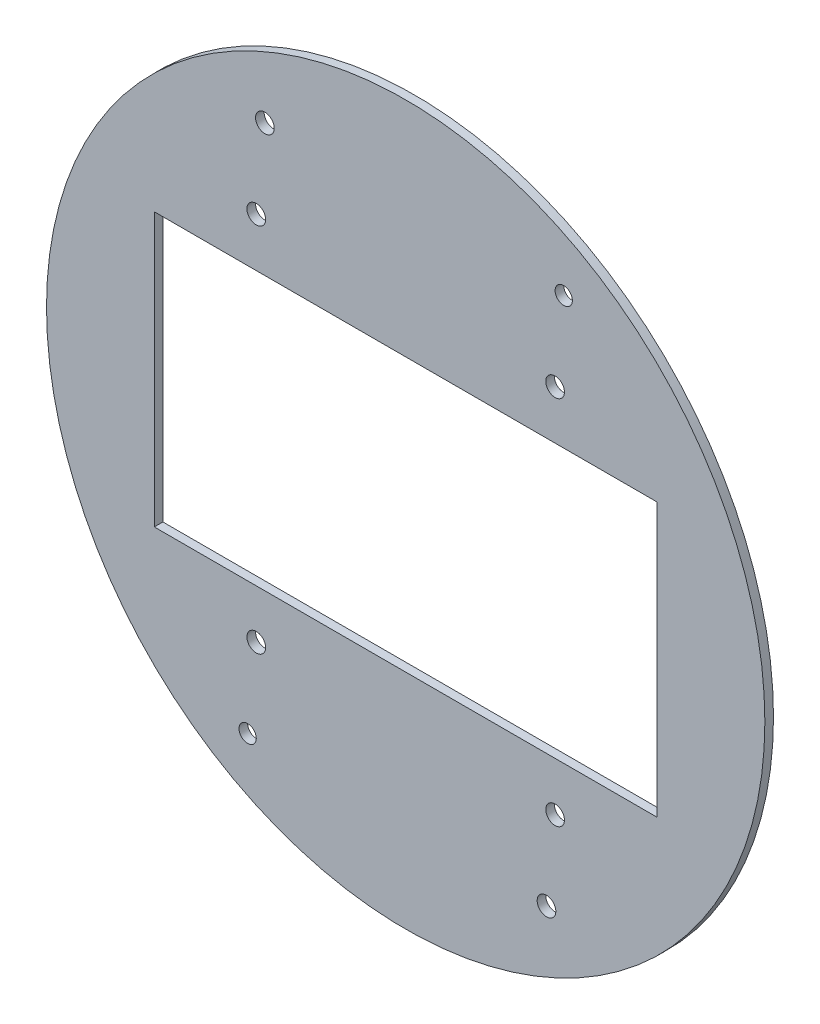
ISO-10303-21;
HEADER;
FILE_DESCRIPTION(('STEP AP214'),'2;1');
FILE_NAME('part.step','',(''),(''),'','','');
FILE_SCHEMA(('AUTOMOTIVE_DESIGN { 1 0 10303 214 1 1 1 1 }'));
ENDSEC;
DATA;
#1=APPLICATION_CONTEXT('core data for automotive mechanical design processes');
#2=APPLICATION_PROTOCOL_DEFINITION('international standard','automotive_design',2000,#1);
#3=PRODUCT_CONTEXT('',#1,'mechanical');
#4=PRODUCT('Part','Part','',(#3));
#5=PRODUCT_RELATED_PRODUCT_CATEGORY('part','',(#4));
#6=PRODUCT_DEFINITION_FORMATION('','',#4);
#7=PRODUCT_DEFINITION_CONTEXT('part definition',#1,'design');
#8=PRODUCT_DEFINITION('design','',#6,#7);
#9=PRODUCT_DEFINITION_SHAPE('','',#8);
#10=(LENGTH_UNIT() NAMED_UNIT(*) SI_UNIT(.MILLI.,.METRE.));
#11=(NAMED_UNIT(*) PLANE_ANGLE_UNIT() SI_UNIT($,.RADIAN.));
#12=(NAMED_UNIT(*) SI_UNIT($,.STERADIAN.) SOLID_ANGLE_UNIT());
#13=UNCERTAINTY_MEASURE_WITH_UNIT(LENGTH_MEASURE(1.E-05),#10,'distance_accuracy_value','');
#14=(GEOMETRIC_REPRESENTATION_CONTEXT(3) GLOBAL_UNCERTAINTY_ASSIGNED_CONTEXT((#13)) GLOBAL_UNIT_ASSIGNED_CONTEXT((#10,
#11,#12)) REPRESENTATION_CONTEXT('',''));
#15=CARTESIAN_POINT('',(0.,0.,0.));
#16=DIRECTION('',(0.,0.,1.));
#17=DIRECTION('',(1.,0.,0.));
#18=AXIS2_PLACEMENT_3D('',#15,#16,#17);
#19=CARTESIAN_POINT('',(0.,0.,3.));
#20=DIRECTION('',(0.,0.,1.));
#21=DIRECTION('',(1.,0.,0.));
#22=AXIS2_PLACEMENT_3D('',#19,#20,#21);
#23=PLANE('',#22);
#24=CARTESIAN_POINT('',(-48.9999999999993,93.5000000000003,3.));
#25=DIRECTION('',(0.,0.,1.));
#26=DIRECTION('',(1.,0.,0.));
#27=AXIS2_PLACEMENT_3D('',#24,#25,#26);
#28=CIRCLE('',#27,3.25000000000001);
#29=CARTESIAN_POINT('',(-45.7499999999993,93.5000000000003,3.));
#30=VERTEX_POINT('',#29);
#31=EDGE_CURVE('E237',#30,#30,#28,.T.);
#32=ORIENTED_EDGE('',*,*,#31,.F.);
#33=EDGE_LOOP('',(#32));
#34=FACE_BOUND('',#33,.T.);
#35=CARTESIAN_POINT('',(-51.9999999999995,64.5000000000004,3.));
#36=DIRECTION('',(0.,0.,1.));
#37=DIRECTION('',(-1.,0.,0.));
#38=AXIS2_PLACEMENT_3D('',#35,#36,#37);
#39=CIRCLE('',#38,3.25);
#40=CARTESIAN_POINT('',(-55.2499999999995,64.5000000000004,3.));
#41=VERTEX_POINT('',#40);
#42=EDGE_CURVE('E239',#41,#41,#39,.T.);
#43=ORIENTED_EDGE('',*,*,#42,.F.);
#44=EDGE_LOOP('',(#43));
#45=FACE_BOUND('',#44,.T.);
#46=CARTESIAN_POINT('',(49.,-93.5,3.));
#47=DIRECTION('',(0.,0.,1.));
#48=DIRECTION('',(1.,0.,0.));
#49=AXIS2_PLACEMENT_3D('',#46,#47,#48);
#50=CIRCLE('',#49,3.25000000000001);
#51=CARTESIAN_POINT('',(52.25,-93.5,3.));
#52=VERTEX_POINT('',#51);
#53=EDGE_CURVE('E245',#52,#52,#50,.T.);
#54=ORIENTED_EDGE('',*,*,#53,.F.);
#55=EDGE_LOOP('',(#54));
#56=FACE_BOUND('',#55,.T.);
#57=CARTESIAN_POINT('',(55.0000000000006,93.4999999999996,3.));
#58=DIRECTION('',(0.,0.,1.));
#59=DIRECTION('',(1.,0.,0.));
#60=AXIS2_PLACEMENT_3D('',#57,#58,#59);
#61=CIRCLE('',#60,3.);
#62=CARTESIAN_POINT('',(58.0000000000006,93.4999999999996,3.));
#63=VERTEX_POINT('',#62);
#64=EDGE_CURVE('E251',#63,#63,#61,.T.);
#65=ORIENTED_EDGE('',*,*,#64,.F.);
#66=EDGE_LOOP('',(#65));
#67=FACE_BOUND('',#66,.T.);
#68=CARTESIAN_POINT('',(52.0000000000004,64.4999999999996,3.));
#69=DIRECTION('',(0.,0.,1.));
#70=DIRECTION('',(1.,0.,0.));
#71=AXIS2_PLACEMENT_3D('',#68,#69,#70);
#72=CIRCLE('',#71,3.25);
#73=CARTESIAN_POINT('',(55.2500000000004,64.4999999999996,3.));
#74=VERTEX_POINT('',#73);
#75=EDGE_CURVE('E257',#74,#74,#72,.T.);
#76=ORIENTED_EDGE('',*,*,#75,.F.);
#77=EDGE_LOOP('',(#76));
#78=FACE_BOUND('',#77,.T.);
#79=CARTESIAN_POINT('',(52.,-64.5,3.));
#80=DIRECTION('',(0.,0.,1.));
#81=DIRECTION('',(-1.,0.,0.));
#82=AXIS2_PLACEMENT_3D('',#79,#80,#81);
#83=CIRCLE('',#82,3.25);
#84=CARTESIAN_POINT('',(48.75,-64.5,3.));
#85=VERTEX_POINT('',#84);
#86=EDGE_CURVE('E263',#85,#85,#83,.T.);
#87=ORIENTED_EDGE('',*,*,#86,.F.);
#88=EDGE_LOOP('',(#87));
#89=FACE_BOUND('',#88,.T.);
#90=CARTESIAN_POINT('',(-55.,-93.5,3.));
#91=DIRECTION('',(0.,0.,1.));
#92=DIRECTION('',(1.,0.,0.));
#93=AXIS2_PLACEMENT_3D('',#90,#91,#92);
#94=CIRCLE('',#93,3.);
#95=CARTESIAN_POINT('',(-52.,-93.5,3.));
#96=VERTEX_POINT('',#95);
#97=EDGE_CURVE('E269',#96,#96,#94,.T.);
#98=ORIENTED_EDGE('',*,*,#97,.F.);
#99=EDGE_LOOP('',(#98));
#100=FACE_BOUND('',#99,.T.);
#101=CARTESIAN_POINT('',(-52.,-64.5,3.));
#102=DIRECTION('',(0.,0.,1.));
#103=DIRECTION('',(1.,0.,0.));
#104=AXIS2_PLACEMENT_3D('',#101,#102,#103);
#105=CIRCLE('',#104,3.25);
#106=CARTESIAN_POINT('',(-48.75,-64.5,3.));
#107=VERTEX_POINT('',#106);
#108=EDGE_CURVE('E275',#107,#107,#105,.T.);
#109=ORIENTED_EDGE('',*,*,#108,.F.);
#110=EDGE_LOOP('',(#109));
#111=FACE_BOUND('',#110,.T.);
#112=CARTESIAN_POINT('',(0.,0.,3.));
#113=DIRECTION('',(0.,0.,1.));
#114=DIRECTION('',(1.,0.,0.));
#115=AXIS2_PLACEMENT_3D('',#112,#113,#114);
#116=CIRCLE('',#115,125.);
#117=CARTESIAN_POINT('',(125.,0.,3.));
#118=VERTEX_POINT('',#117);
#119=EDGE_CURVE('E11',#118,#118,#116,.T.);
#120=ORIENTED_EDGE('',*,*,#119,.T.);
#121=EDGE_LOOP('',(#120));
#122=FACE_BOUND('',#121,.T.);
#123=DIRECTION('',(-1.,0.,0.));
#124=VECTOR('',#123,1.);
#125=CARTESIAN_POINT('',(-87.5,47.5,3.));
#126=LINE('',#125,#124);
#127=CARTESIAN_POINT('',(87.5,47.5,3.));
#128=VERTEX_POINT('',#127);
#129=CARTESIAN_POINT('',(-87.5,47.5,3.));
#130=VERTEX_POINT('',#129);
#131=EDGE_CURVE('E82',#128,#130,#126,.T.);
#132=ORIENTED_EDGE('',*,*,#131,.F.);
#133=DIRECTION('',(0.,1.,0.));
#134=VECTOR('',#133,1.);
#135=CARTESIAN_POINT('',(87.5,-47.5,3.));
#136=LINE('',#135,#134);
#137=CARTESIAN_POINT('',(87.5,-47.5,3.));
#138=VERTEX_POINT('',#137);
#139=EDGE_CURVE('E74',#138,#128,#136,.T.);
#140=ORIENTED_EDGE('',*,*,#139,.F.);
#141=DIRECTION('',(1.,0.,0.));
#142=VECTOR('',#141,1.);
#143=CARTESIAN_POINT('',(-87.5,-47.5,3.));
#144=LINE('',#143,#142);
#145=CARTESIAN_POINT('',(-87.5,-47.5,3.));
#146=VERTEX_POINT('',#145);
#147=EDGE_CURVE('E95',#146,#138,#144,.T.);
#148=ORIENTED_EDGE('',*,*,#147,.F.);
#149=DIRECTION('',(0.,-1.,0.));
#150=VECTOR('',#149,1.);
#151=CARTESIAN_POINT('',(-87.5,-47.5,3.));
#152=LINE('',#151,#150);
#153=EDGE_CURVE('E93',#130,#146,#152,.T.);
#154=ORIENTED_EDGE('',*,*,#153,.F.);
#155=EDGE_LOOP('',(#132,#140,#148,#154));
#156=FACE_BOUND('',#155,.T.);
#157=ADVANCED_FACE('F33',(#34,#45,#56,#67,#78,#89,#100,#111,#122,#156),#23,.T.);
#158=CARTESIAN_POINT('',(0.,0.,0.));
#159=DIRECTION('',(0.,0.,1.));
#160=DIRECTION('',(1.,0.,0.));
#161=AXIS2_PLACEMENT_3D('',#158,#159,#160);
#162=PLANE('',#161);
#163=CARTESIAN_POINT('',(-48.9999999999993,93.5000000000003,0.));
#164=DIRECTION('',(0.,0.,1.));
#165=DIRECTION('',(1.,0.,0.));
#166=AXIS2_PLACEMENT_3D('',#163,#164,#165);
#167=CIRCLE('',#166,3.25000000000001);
#168=CARTESIAN_POINT('',(-45.7499999999993,93.5000000000003,0.));
#169=VERTEX_POINT('',#168);
#170=EDGE_CURVE('E235',#169,#169,#167,.T.);
#171=ORIENTED_EDGE('',*,*,#170,.T.);
#172=EDGE_LOOP('',(#171));
#173=FACE_BOUND('',#172,.T.);
#174=CARTESIAN_POINT('',(-51.9999999999995,64.5000000000004,0.));
#175=DIRECTION('',(0.,0.,1.));
#176=DIRECTION('',(-1.,0.,0.));
#177=AXIS2_PLACEMENT_3D('',#174,#175,#176);
#178=CIRCLE('',#177,3.25);
#179=CARTESIAN_POINT('',(-55.2499999999995,64.5000000000004,0.));
#180=VERTEX_POINT('',#179);
#181=EDGE_CURVE('E242',#180,#180,#178,.T.);
#182=ORIENTED_EDGE('',*,*,#181,.T.);
#183=EDGE_LOOP('',(#182));
#184=FACE_BOUND('',#183,.T.);
#185=CARTESIAN_POINT('',(49.,-93.5,0.));
#186=DIRECTION('',(0.,0.,1.));
#187=DIRECTION('',(1.,0.,0.));
#188=AXIS2_PLACEMENT_3D('',#185,#186,#187);
#189=CIRCLE('',#188,3.25000000000001);
#190=CARTESIAN_POINT('',(52.25,-93.5,0.));
#191=VERTEX_POINT('',#190);
#192=EDGE_CURVE('E248',#191,#191,#189,.T.);
#193=ORIENTED_EDGE('',*,*,#192,.T.);
#194=EDGE_LOOP('',(#193));
#195=FACE_BOUND('',#194,.T.);
#196=CARTESIAN_POINT('',(55.0000000000006,93.4999999999996,0.));
#197=DIRECTION('',(0.,0.,1.));
#198=DIRECTION('',(1.,0.,0.));
#199=AXIS2_PLACEMENT_3D('',#196,#197,#198);
#200=CIRCLE('',#199,3.);
#201=CARTESIAN_POINT('',(58.0000000000006,93.4999999999996,0.));
#202=VERTEX_POINT('',#201);
#203=EDGE_CURVE('E254',#202,#202,#200,.T.);
#204=ORIENTED_EDGE('',*,*,#203,.T.);
#205=EDGE_LOOP('',(#204));
#206=FACE_BOUND('',#205,.T.);
#207=CARTESIAN_POINT('',(52.0000000000004,64.4999999999996,0.));
#208=DIRECTION('',(0.,0.,1.));
#209=DIRECTION('',(1.,0.,0.));
#210=AXIS2_PLACEMENT_3D('',#207,#208,#209);
#211=CIRCLE('',#210,3.25);
#212=CARTESIAN_POINT('',(55.2500000000004,64.4999999999996,0.));
#213=VERTEX_POINT('',#212);
#214=EDGE_CURVE('E260',#213,#213,#211,.T.);
#215=ORIENTED_EDGE('',*,*,#214,.T.);
#216=EDGE_LOOP('',(#215));
#217=FACE_BOUND('',#216,.T.);
#218=CARTESIAN_POINT('',(52.,-64.5,0.));
#219=DIRECTION('',(0.,0.,1.));
#220=DIRECTION('',(-1.,0.,0.));
#221=AXIS2_PLACEMENT_3D('',#218,#219,#220);
#222=CIRCLE('',#221,3.25);
#223=CARTESIAN_POINT('',(48.75,-64.5,0.));
#224=VERTEX_POINT('',#223);
#225=EDGE_CURVE('E266',#224,#224,#222,.T.);
#226=ORIENTED_EDGE('',*,*,#225,.T.);
#227=EDGE_LOOP('',(#226));
#228=FACE_BOUND('',#227,.T.);
#229=CARTESIAN_POINT('',(-55.,-93.5,0.));
#230=DIRECTION('',(0.,0.,1.));
#231=DIRECTION('',(1.,0.,0.));
#232=AXIS2_PLACEMENT_3D('',#229,#230,#231);
#233=CIRCLE('',#232,3.);
#234=CARTESIAN_POINT('',(-52.,-93.5,0.));
#235=VERTEX_POINT('',#234);
#236=EDGE_CURVE('E272',#235,#235,#233,.T.);
#237=ORIENTED_EDGE('',*,*,#236,.T.);
#238=EDGE_LOOP('',(#237));
#239=FACE_BOUND('',#238,.T.);
#240=CARTESIAN_POINT('',(-52.,-64.5,0.));
#241=DIRECTION('',(0.,0.,1.));
#242=DIRECTION('',(1.,0.,0.));
#243=AXIS2_PLACEMENT_3D('',#240,#241,#242);
#244=CIRCLE('',#243,3.25);
#245=CARTESIAN_POINT('',(-48.75,-64.5,0.));
#246=VERTEX_POINT('',#245);
#247=EDGE_CURVE('E101',#246,#246,#244,.T.);
#248=ORIENTED_EDGE('',*,*,#247,.T.);
#249=EDGE_LOOP('',(#248));
#250=FACE_BOUND('',#249,.T.);
#251=CARTESIAN_POINT('',(0.,0.,0.));
#252=DIRECTION('',(0.,0.,1.));
#253=DIRECTION('',(1.,0.,0.));
#254=AXIS2_PLACEMENT_3D('',#251,#252,#253);
#255=CIRCLE('',#254,125.);
#256=CARTESIAN_POINT('',(125.,0.,0.));
#257=VERTEX_POINT('',#256);
#258=EDGE_CURVE('E37',#257,#257,#255,.T.);
#259=ORIENTED_EDGE('',*,*,#258,.F.);
#260=EDGE_LOOP('',(#259));
#261=FACE_BOUND('',#260,.T.);
#262=DIRECTION('',(0.,1.,0.));
#263=VECTOR('',#262,1.);
#264=CARTESIAN_POINT('',(87.5,-47.5,0.));
#265=LINE('',#264,#263);
#266=CARTESIAN_POINT('',(87.5,-47.5,0.));
#267=VERTEX_POINT('',#266);
#268=CARTESIAN_POINT('',(87.5,47.5,0.));
#269=VERTEX_POINT('',#268);
#270=EDGE_CURVE('E56',#267,#269,#265,.T.);
#271=ORIENTED_EDGE('',*,*,#270,.T.);
#272=DIRECTION('',(-1.,0.,0.));
#273=VECTOR('',#272,1.);
#274=CARTESIAN_POINT('',(-87.5,47.5,0.));
#275=LINE('',#274,#273);
#276=CARTESIAN_POINT('',(-87.5,47.5,0.));
#277=VERTEX_POINT('',#276);
#278=EDGE_CURVE('E89',#269,#277,#275,.T.);
#279=ORIENTED_EDGE('',*,*,#278,.T.);
#280=DIRECTION('',(0.,-1.,0.));
#281=VECTOR('',#280,1.);
#282=CARTESIAN_POINT('',(-87.5,-47.5,0.));
#283=LINE('',#282,#281);
#284=CARTESIAN_POINT('',(-87.5,-47.5,0.));
#285=VERTEX_POINT('',#284);
#286=EDGE_CURVE('E103',#277,#285,#283,.T.);
#287=ORIENTED_EDGE('',*,*,#286,.T.);
#288=DIRECTION('',(1.,0.,0.));
#289=VECTOR('',#288,1.);
#290=CARTESIAN_POINT('',(-87.5,-47.5,0.));
#291=LINE('',#290,#289);
#292=EDGE_CURVE('E83',#285,#267,#291,.T.);
#293=ORIENTED_EDGE('',*,*,#292,.T.);
#294=EDGE_LOOP('',(#271,#279,#287,#293));
#295=FACE_BOUND('',#294,.T.);
#296=ADVANCED_FACE('F114',(#173,#184,#195,#206,#217,#228,#239,#250,#261,#295),#162,.F.);
#297=CARTESIAN_POINT('',(0.,0.,3.));
#298=DIRECTION('',(0.,0.,-1.));
#299=DIRECTION('',(-1.,0.,0.));
#300=AXIS2_PLACEMENT_3D('',#297,#298,#299);
#301=CYLINDRICAL_SURFACE('',#300,125.);
#302=ORIENTED_EDGE('',*,*,#119,.F.);
#303=EDGE_LOOP('',(#302));
#304=FACE_BOUND('',#303,.T.);
#305=ORIENTED_EDGE('',*,*,#258,.T.);
#306=EDGE_LOOP('',(#305));
#307=FACE_BOUND('',#306,.T.);
#308=ADVANCED_FACE('F35',(#304,#307),#301,.T.);
#309=CARTESIAN_POINT('',(87.5,-47.5,3.));
#310=DIRECTION('',(-1.,0.,0.));
#311=DIRECTION('',(0.,0.,1.));
#312=AXIS2_PLACEMENT_3D('',#309,#310,#311);
#313=PLANE('',#312);
#314=ORIENTED_EDGE('',*,*,#270,.F.);
#315=DIRECTION('',(0.,0.,-1.));
#316=VECTOR('',#315,1.);
#317=CARTESIAN_POINT('',(87.5,-47.5,3.));
#318=LINE('',#317,#316);
#319=EDGE_CURVE('E78',#138,#267,#318,.T.);
#320=ORIENTED_EDGE('',*,*,#319,.F.);
#321=ORIENTED_EDGE('',*,*,#139,.T.);
#322=DIRECTION('',(0.,0.,-1.));
#323=VECTOR('',#322,1.);
#324=CARTESIAN_POINT('',(87.5,47.5,3.));
#325=LINE('',#324,#323);
#326=EDGE_CURVE('E77',#128,#269,#325,.T.);
#327=ORIENTED_EDGE('',*,*,#326,.T.);
#328=EDGE_LOOP('',(#314,#320,#321,#327));
#329=FACE_BOUND('',#328,.T.);
#330=ADVANCED_FACE('F76',(#329),#313,.T.);
#331=CARTESIAN_POINT('',(-87.5,47.5,3.));
#332=DIRECTION('',(0.,-1.,0.));
#333=DIRECTION('',(0.,0.,-1.));
#334=AXIS2_PLACEMENT_3D('',#331,#332,#333);
#335=PLANE('',#334);
#336=ORIENTED_EDGE('',*,*,#278,.F.);
#337=ORIENTED_EDGE('',*,*,#326,.F.);
#338=ORIENTED_EDGE('',*,*,#131,.T.);
#339=DIRECTION('',(0.,0.,-1.));
#340=VECTOR('',#339,1.);
#341=CARTESIAN_POINT('',(-87.5,47.5,3.));
#342=LINE('',#341,#340);
#343=EDGE_CURVE('E90',#130,#277,#342,.T.);
#344=ORIENTED_EDGE('',*,*,#343,.T.);
#345=EDGE_LOOP('',(#336,#337,#338,#344));
#346=FACE_BOUND('',#345,.T.);
#347=ADVANCED_FACE('F86',(#346),#335,.T.);
#348=CARTESIAN_POINT('',(-87.5,-47.5,3.));
#349=DIRECTION('',(1.,0.,0.));
#350=DIRECTION('',(0.,0.,-1.));
#351=AXIS2_PLACEMENT_3D('',#348,#349,#350);
#352=PLANE('',#351);
#353=ORIENTED_EDGE('',*,*,#286,.F.);
#354=ORIENTED_EDGE('',*,*,#343,.F.);
#355=ORIENTED_EDGE('',*,*,#153,.T.);
#356=DIRECTION('',(0.,0.,-1.));
#357=VECTOR('',#356,1.);
#358=CARTESIAN_POINT('',(-87.5,-47.5,3.));
#359=LINE('',#358,#357);
#360=EDGE_CURVE('E48',#146,#285,#359,.T.);
#361=ORIENTED_EDGE('',*,*,#360,.T.);
#362=EDGE_LOOP('',(#353,#354,#355,#361));
#363=FACE_BOUND('',#362,.T.);
#364=ADVANCED_FACE('F112',(#363),#352,.T.);
#365=CARTESIAN_POINT('',(-87.5,-47.5,3.));
#366=DIRECTION('',(0.,1.,0.));
#367=DIRECTION('',(0.,0.,1.));
#368=AXIS2_PLACEMENT_3D('',#365,#366,#367);
#369=PLANE('',#368);
#370=ORIENTED_EDGE('',*,*,#292,.F.);
#371=ORIENTED_EDGE('',*,*,#360,.F.);
#372=ORIENTED_EDGE('',*,*,#147,.T.);
#373=ORIENTED_EDGE('',*,*,#319,.T.);
#374=EDGE_LOOP('',(#370,#371,#372,#373));
#375=FACE_BOUND('',#374,.T.);
#376=ADVANCED_FACE('F115',(#375),#369,.T.);
#377=CARTESIAN_POINT('',(-52.,-64.5,0.));
#378=DIRECTION('',(0.,0.,1.));
#379=DIRECTION('',(1.,0.,0.));
#380=AXIS2_PLACEMENT_3D('',#377,#378,#379);
#381=CYLINDRICAL_SURFACE('',#380,3.25);
#382=ORIENTED_EDGE('',*,*,#247,.F.);
#383=EDGE_LOOP('',(#382));
#384=FACE_BOUND('',#383,.T.);
#385=ORIENTED_EDGE('',*,*,#108,.T.);
#386=EDGE_LOOP('',(#385));
#387=FACE_BOUND('',#386,.T.);
#388=ADVANCED_FACE('F117',(#384,#387),#381,.F.);
#389=CARTESIAN_POINT('',(-55.,-93.5,0.));
#390=DIRECTION('',(0.,0.,1.));
#391=DIRECTION('',(1.,0.,0.));
#392=AXIS2_PLACEMENT_3D('',#389,#390,#391);
#393=CYLINDRICAL_SURFACE('',#392,3.);
#394=ORIENTED_EDGE('',*,*,#236,.F.);
#395=EDGE_LOOP('',(#394));
#396=FACE_BOUND('',#395,.T.);
#397=ORIENTED_EDGE('',*,*,#97,.T.);
#398=EDGE_LOOP('',(#397));
#399=FACE_BOUND('',#398,.T.);
#400=ADVANCED_FACE('F123',(#396,#399),#393,.F.);
#401=CARTESIAN_POINT('',(52.,-64.5,0.));
#402=DIRECTION('',(0.,0.,1.));
#403=DIRECTION('',(1.,0.,0.));
#404=AXIS2_PLACEMENT_3D('',#401,#402,#403);
#405=CYLINDRICAL_SURFACE('',#404,3.25);
#406=ORIENTED_EDGE('',*,*,#225,.F.);
#407=EDGE_LOOP('',(#406));
#408=FACE_BOUND('',#407,.T.);
#409=ORIENTED_EDGE('',*,*,#86,.T.);
#410=EDGE_LOOP('',(#409));
#411=FACE_BOUND('',#410,.T.);
#412=ADVANCED_FACE('F168',(#408,#411),#405,.F.);
#413=CARTESIAN_POINT('',(52.0000000000004,64.4999999999996,0.));
#414=DIRECTION('',(0.,0.,1.));
#415=DIRECTION('',(1.,0.,0.));
#416=AXIS2_PLACEMENT_3D('',#413,#414,#415);
#417=CYLINDRICAL_SURFACE('',#416,3.25);
#418=ORIENTED_EDGE('',*,*,#214,.F.);
#419=EDGE_LOOP('',(#418));
#420=FACE_BOUND('',#419,.T.);
#421=ORIENTED_EDGE('',*,*,#75,.T.);
#422=EDGE_LOOP('',(#421));
#423=FACE_BOUND('',#422,.T.);
#424=ADVANCED_FACE('F177',(#420,#423),#417,.F.);
#425=CARTESIAN_POINT('',(55.0000000000006,93.4999999999996,0.));
#426=DIRECTION('',(0.,0.,1.));
#427=DIRECTION('',(1.,0.,0.));
#428=AXIS2_PLACEMENT_3D('',#425,#426,#427);
#429=CYLINDRICAL_SURFACE('',#428,3.);
#430=ORIENTED_EDGE('',*,*,#203,.F.);
#431=EDGE_LOOP('',(#430));
#432=FACE_BOUND('',#431,.T.);
#433=ORIENTED_EDGE('',*,*,#64,.T.);
#434=EDGE_LOOP('',(#433));
#435=FACE_BOUND('',#434,.T.);
#436=ADVANCED_FACE('F186',(#432,#435),#429,.F.);
#437=CARTESIAN_POINT('',(49.,-93.5,0.));
#438=DIRECTION('',(0.,0.,1.));
#439=DIRECTION('',(1.,0.,0.));
#440=AXIS2_PLACEMENT_3D('',#437,#438,#439);
#441=CYLINDRICAL_SURFACE('',#440,3.25000000000001);
#442=ORIENTED_EDGE('',*,*,#192,.F.);
#443=EDGE_LOOP('',(#442));
#444=FACE_BOUND('',#443,.T.);
#445=ORIENTED_EDGE('',*,*,#53,.T.);
#446=EDGE_LOOP('',(#445));
#447=FACE_BOUND('',#446,.T.);
#448=ADVANCED_FACE('F195',(#444,#447),#441,.F.);
#449=CARTESIAN_POINT('',(-51.9999999999995,64.5000000000004,0.));
#450=DIRECTION('',(0.,0.,1.));
#451=DIRECTION('',(1.,0.,0.));
#452=AXIS2_PLACEMENT_3D('',#449,#450,#451);
#453=CYLINDRICAL_SURFACE('',#452,3.25);
#454=ORIENTED_EDGE('',*,*,#181,.F.);
#455=EDGE_LOOP('',(#454));
#456=FACE_BOUND('',#455,.T.);
#457=ORIENTED_EDGE('',*,*,#42,.T.);
#458=EDGE_LOOP('',(#457));
#459=FACE_BOUND('',#458,.T.);
#460=ADVANCED_FACE('F204',(#456,#459),#453,.F.);
#461=CARTESIAN_POINT('',(-48.9999999999993,93.5000000000003,0.));
#462=DIRECTION('',(0.,0.,1.));
#463=DIRECTION('',(1.,0.,0.));
#464=AXIS2_PLACEMENT_3D('',#461,#462,#463);
#465=CYLINDRICAL_SURFACE('',#464,3.25000000000001);
#466=ORIENTED_EDGE('',*,*,#170,.F.);
#467=EDGE_LOOP('',(#466));
#468=FACE_BOUND('',#467,.T.);
#469=ORIENTED_EDGE('',*,*,#31,.T.);
#470=EDGE_LOOP('',(#469));
#471=FACE_BOUND('',#470,.T.);
#472=ADVANCED_FACE('F213',(#468,#471),#465,.F.);
#473=CLOSED_SHELL('',(#157,#296,#308,#330,#347,#364,#376,#388,#400,#412,#424,#436,#448,#460,#472));
#474=MANIFOLD_SOLID_BREP('B2',#473);
#475=ADVANCED_BREP_SHAPE_REPRESENTATION('',(#18,#474),#14);
#476=SHAPE_DEFINITION_REPRESENTATION(#9,#475);
ENDSEC;
END-ISO-10303-21;
